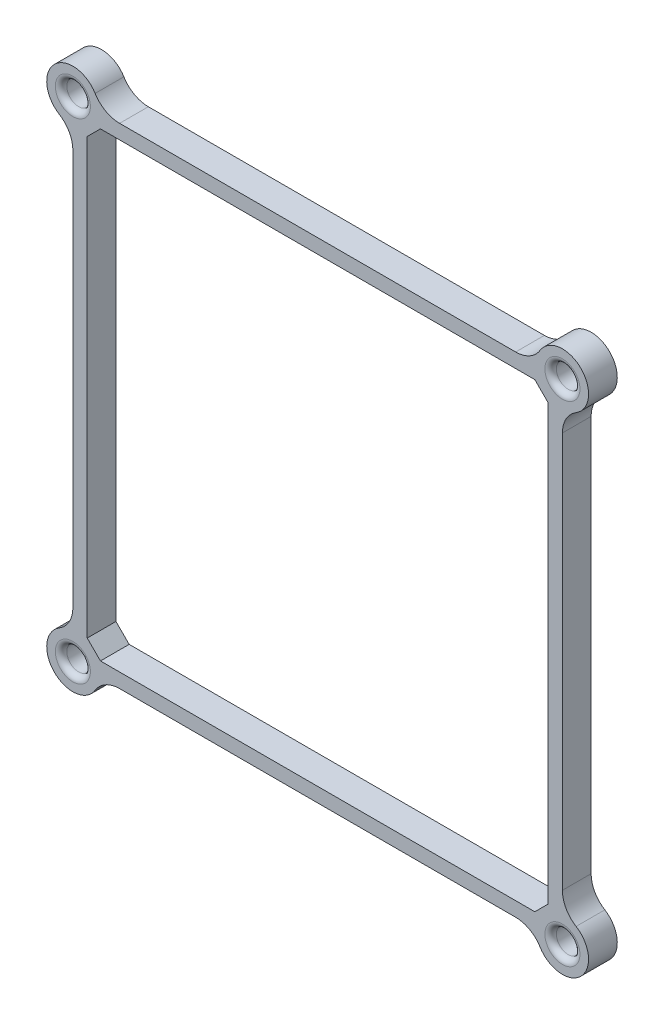
ISO-10303-21;
HEADER;
FILE_DESCRIPTION(('STEP AP214'),'2;1');
FILE_NAME('part.step','',(''),(''),'','','');
FILE_SCHEMA(('AUTOMOTIVE_DESIGN { 1 0 10303 214 1 1 1 1 }'));
ENDSEC;
DATA;
#1=APPLICATION_CONTEXT('core data for automotive mechanical design processes');
#2=APPLICATION_PROTOCOL_DEFINITION('international standard','automotive_design',2000,#1);
#3=PRODUCT_CONTEXT('',#1,'mechanical');
#4=PRODUCT('Part','Part','',(#3));
#5=PRODUCT_RELATED_PRODUCT_CATEGORY('part','',(#4));
#6=PRODUCT_DEFINITION_FORMATION('','',#4);
#7=PRODUCT_DEFINITION_CONTEXT('part definition',#1,'design');
#8=PRODUCT_DEFINITION('design','',#6,#7);
#9=PRODUCT_DEFINITION_SHAPE('','',#8);
#10=(LENGTH_UNIT() NAMED_UNIT(*) SI_UNIT(.MILLI.,.METRE.));
#11=(NAMED_UNIT(*) PLANE_ANGLE_UNIT() SI_UNIT($,.RADIAN.));
#12=(NAMED_UNIT(*) SI_UNIT($,.STERADIAN.) SOLID_ANGLE_UNIT());
#13=UNCERTAINTY_MEASURE_WITH_UNIT(LENGTH_MEASURE(1.E-05),#10,'distance_accuracy_value','');
#14=(GEOMETRIC_REPRESENTATION_CONTEXT(3) GLOBAL_UNCERTAINTY_ASSIGNED_CONTEXT((#13)) GLOBAL_UNIT_ASSIGNED_CONTEXT((#10,
#11,#12)) REPRESENTATION_CONTEXT('',''));
#15=CARTESIAN_POINT('',(0.,0.,0.));
#16=DIRECTION('',(0.,0.,1.));
#17=DIRECTION('',(1.,0.,0.));
#18=AXIS2_PLACEMENT_3D('',#15,#16,#17);
#19=CARTESIAN_POINT('',(82.7,-82.7,5.));
#20=DIRECTION('',(0.,0.,-1.));
#21=DIRECTION('',(-1.,0.,0.));
#22=AXIS2_PLACEMENT_3D('',#19,#20,#21);
#23=CYLINDRICAL_SURFACE('',#22,2.04999999999999);
#24=CARTESIAN_POINT('',(82.7,-82.7,4.));
#25=DIRECTION('',(0.,0.,1.));
#26=DIRECTION('',(1.,0.,0.));
#27=AXIS2_PLACEMENT_3D('',#24,#25,#26);
#28=CIRCLE('',#27,2.04999999999999);
#29=CARTESIAN_POINT('',(84.75,-82.7,4.));
#30=VERTEX_POINT('',#29);
#31=EDGE_CURVE('E348',#30,#30,#28,.T.);
#32=ORIENTED_EDGE('',*,*,#31,.T.);
#33=EDGE_LOOP('',(#32));
#34=FACE_BOUND('',#33,.T.);
#35=CARTESIAN_POINT('',(82.7,-82.7,1.));
#36=DIRECTION('',(0.,0.,-1.));
#37=DIRECTION('',(-1.,0.,0.));
#38=AXIS2_PLACEMENT_3D('',#35,#36,#37);
#39=CIRCLE('',#38,2.04999999999999);
#40=CARTESIAN_POINT('',(80.65,-82.7,1.));
#41=VERTEX_POINT('',#40);
#42=EDGE_CURVE('E502',#41,#41,#39,.T.);
#43=ORIENTED_EDGE('',*,*,#42,.T.);
#44=EDGE_LOOP('',(#43));
#45=FACE_BOUND('',#44,.T.);
#46=ADVANCED_FACE('F41',(#34,#45),#23,.F.);
#47=CARTESIAN_POINT('',(-2.5,-82.7,5.));
#48=DIRECTION('',(0.,0.,-1.));
#49=DIRECTION('',(-1.,0.,0.));
#50=AXIS2_PLACEMENT_3D('',#47,#48,#49);
#51=CYLINDRICAL_SURFACE('',#50,2.05);
#52=CARTESIAN_POINT('',(-2.5,-82.7,4.));
#53=DIRECTION('',(0.,0.,1.));
#54=DIRECTION('',(1.,0.,0.));
#55=AXIS2_PLACEMENT_3D('',#52,#53,#54);
#56=CIRCLE('',#55,2.05);
#57=CARTESIAN_POINT('',(-0.450000000000002,-82.7,4.));
#58=VERTEX_POINT('',#57);
#59=EDGE_CURVE('E333',#58,#58,#56,.T.);
#60=ORIENTED_EDGE('',*,*,#59,.T.);
#61=EDGE_LOOP('',(#60));
#62=FACE_BOUND('',#61,.T.);
#63=CARTESIAN_POINT('',(-2.5,-82.7,1.));
#64=DIRECTION('',(0.,0.,-1.));
#65=DIRECTION('',(-1.,0.,0.));
#66=AXIS2_PLACEMENT_3D('',#63,#64,#65);
#67=CIRCLE('',#66,2.05);
#68=CARTESIAN_POINT('',(-4.55,-82.7,1.));
#69=VERTEX_POINT('',#68);
#70=EDGE_CURVE('E499',#69,#69,#67,.T.);
#71=ORIENTED_EDGE('',*,*,#70,.T.);
#72=EDGE_LOOP('',(#71));
#73=FACE_BOUND('',#72,.T.);
#74=ADVANCED_FACE('F371',(#62,#73),#51,.F.);
#75=CARTESIAN_POINT('',(-2.50000000000029,2.5,5.));
#76=DIRECTION('',(0.,0.,-1.));
#77=DIRECTION('',(-1.,0.,0.));
#78=AXIS2_PLACEMENT_3D('',#75,#76,#77);
#79=CYLINDRICAL_SURFACE('',#78,2.05);
#80=CARTESIAN_POINT('',(-2.50000000000029,2.5,4.));
#81=DIRECTION('',(0.,0.,1.));
#82=DIRECTION('',(1.,0.,0.));
#83=AXIS2_PLACEMENT_3D('',#80,#81,#82);
#84=CIRCLE('',#83,2.05);
#85=CARTESIAN_POINT('',(-0.450000000000293,2.5,4.));
#86=VERTEX_POINT('',#85);
#87=EDGE_CURVE('E11',#86,#86,#84,.T.);
#88=ORIENTED_EDGE('',*,*,#87,.T.);
#89=EDGE_LOOP('',(#88));
#90=FACE_BOUND('',#89,.T.);
#91=CARTESIAN_POINT('',(-2.50000000000029,2.5,1.));
#92=DIRECTION('',(0.,0.,-1.));
#93=DIRECTION('',(-1.,0.,0.));
#94=AXIS2_PLACEMENT_3D('',#91,#92,#93);
#95=CIRCLE('',#94,2.05);
#96=CARTESIAN_POINT('',(-4.55000000000029,2.5,1.));
#97=VERTEX_POINT('',#96);
#98=EDGE_CURVE('E501',#97,#97,#95,.T.);
#99=ORIENTED_EDGE('',*,*,#98,.T.);
#100=EDGE_LOOP('',(#99));
#101=FACE_BOUND('',#100,.T.);
#102=ADVANCED_FACE('F377',(#90,#101),#79,.F.);
#103=CARTESIAN_POINT('',(82.6999999999997,2.5,5.));
#104=DIRECTION('',(0.,0.,-1.));
#105=DIRECTION('',(-1.,0.,0.));
#106=AXIS2_PLACEMENT_3D('',#103,#104,#105);
#107=CYLINDRICAL_SURFACE('',#106,2.04999999999999);
#108=CARTESIAN_POINT('',(82.6999999999997,2.5,4.));
#109=DIRECTION('',(0.,0.,1.));
#110=DIRECTION('',(1.,0.,0.));
#111=AXIS2_PLACEMENT_3D('',#108,#109,#110);
#112=CIRCLE('',#111,2.04999999999999);
#113=CARTESIAN_POINT('',(84.7499999999997,2.5,4.));
#114=VERTEX_POINT('',#113);
#115=EDGE_CURVE('E49',#114,#114,#112,.T.);
#116=ORIENTED_EDGE('',*,*,#115,.T.);
#117=EDGE_LOOP('',(#116));
#118=FACE_BOUND('',#117,.T.);
#119=CARTESIAN_POINT('',(82.6999999999997,2.5,1.));
#120=DIRECTION('',(0.,0.,-1.));
#121=DIRECTION('',(-1.,0.,0.));
#122=AXIS2_PLACEMENT_3D('',#119,#120,#121);
#123=CIRCLE('',#122,2.04999999999999);
#124=CARTESIAN_POINT('',(80.6499999999997,2.5,1.));
#125=VERTEX_POINT('',#124);
#126=EDGE_CURVE('E505',#125,#125,#123,.T.);
#127=ORIENTED_EDGE('',*,*,#126,.T.);
#128=EDGE_LOOP('',(#127));
#129=FACE_BOUND('',#128,.T.);
#130=ADVANCED_FACE('F353',(#118,#129),#107,.F.);
#131=CARTESIAN_POINT('',(-2.50000000000029,2.5,5.));
#132=DIRECTION('',(0.,0.,-1.));
#133=DIRECTION('',(-1.,0.,0.));
#134=AXIS2_PLACEMENT_3D('',#131,#132,#133);
#135=CYLINDRICAL_SURFACE('',#134,4.55);
#136=DIRECTION('',(0.,0.,-1.));
#137=VECTOR('',#136,1.);
#138=CARTESIAN_POINT('',(-4.88219895287973,-1.37654848401256,5.));
#139=LINE('',#138,#137);
#140=CARTESIAN_POINT('',(-4.88219895287973,-1.37654848401256,0.));
#141=VERTEX_POINT('',#140);
#142=CARTESIAN_POINT('',(-4.88219895287973,-1.37654848401256,5.));
#143=VERTEX_POINT('',#142);
#144=EDGE_CURVE('E56',#141,#143,#139,.F.);
#145=ORIENTED_EDGE('',*,*,#144,.T.);
#146=CARTESIAN_POINT('',(-2.50000000000029,2.5,5.));
#147=DIRECTION('',(0.,0.,1.));
#148=DIRECTION('',(1.,0.,0.));
#149=AXIS2_PLACEMENT_3D('',#146,#147,#148);
#150=CIRCLE('',#149,4.55);
#151=CARTESIAN_POINT('',(1.37654848401218,4.88219895287958,5.));
#152=VERTEX_POINT('',#151);
#153=EDGE_CURVE('E524',#152,#143,#150,.T.);
#154=ORIENTED_EDGE('',*,*,#153,.F.);
#155=DIRECTION('',(0.,0.,-1.));
#156=VECTOR('',#155,1.);
#157=CARTESIAN_POINT('',(1.37654848401218,4.88219895287958,5.));
#158=LINE('',#157,#156);
#159=CARTESIAN_POINT('',(1.37654848401218,4.88219895287958,0.));
#160=VERTEX_POINT('',#159);
#161=EDGE_CURVE('E300',#152,#160,#158,.T.);
#162=ORIENTED_EDGE('',*,*,#161,.T.);
#163=CARTESIAN_POINT('',(-2.50000000000029,2.5,0.));
#164=DIRECTION('',(0.,0.,1.));
#165=DIRECTION('',(1.,0.,0.));
#166=AXIS2_PLACEMENT_3D('',#163,#164,#165);
#167=CIRCLE('',#166,4.55);
#168=EDGE_CURVE('E548',#160,#141,#167,.T.);
#169=ORIENTED_EDGE('',*,*,#168,.T.);
#170=EDGE_LOOP('',(#145,#154,#162,#169));
#171=FACE_BOUND('',#170,.T.);
#172=ADVANCED_FACE('F412',(#171),#135,.T.);
#173=CARTESIAN_POINT('',(-2.5,0.,5.));
#174=DIRECTION('',(1.,0.,0.));
#175=DIRECTION('',(0.,0.,-1.));
#176=AXIS2_PLACEMENT_3D('',#173,#174,#175);
#177=PLANE('',#176);
#178=DIRECTION('',(0.,-1.,0.));
#179=VECTOR('',#178,1.);
#180=CARTESIAN_POINT('',(-2.5,0.,0.));
#181=LINE('',#180,#179);
#182=CARTESIAN_POINT('',(-2.5,-5.63649187303735,0.));
#183=VERTEX_POINT('',#182);
#184=CARTESIAN_POINT('',(-2.5,-74.5635081269628,0.));
#185=VERTEX_POINT('',#184);
#186=EDGE_CURVE('E550',#183,#185,#181,.T.);
#187=ORIENTED_EDGE('',*,*,#186,.T.);
#188=DIRECTION('',(0.,0.,1.));
#189=VECTOR('',#188,1.);
#190=CARTESIAN_POINT('',(-2.5,-74.5635081269628,5.));
#191=LINE('',#190,#189);
#192=CARTESIAN_POINT('',(-2.5,-74.5635081269628,5.));
#193=VERTEX_POINT('',#192);
#194=EDGE_CURVE('E274',#185,#193,#191,.T.);
#195=ORIENTED_EDGE('',*,*,#194,.T.);
#196=DIRECTION('',(0.,-1.,0.));
#197=VECTOR('',#196,1.);
#198=CARTESIAN_POINT('',(-2.5,0.,5.));
#199=LINE('',#198,#197);
#200=CARTESIAN_POINT('',(-2.5,-5.63649187303735,5.));
#201=VERTEX_POINT('',#200);
#202=EDGE_CURVE('E526',#201,#193,#199,.T.);
#203=ORIENTED_EDGE('',*,*,#202,.F.);
#204=DIRECTION('',(0.,0.,1.));
#205=VECTOR('',#204,1.);
#206=CARTESIAN_POINT('',(-2.5,-5.63649187303735,0.));
#207=LINE('',#206,#205);
#208=EDGE_CURVE('E271',#201,#183,#207,.F.);
#209=ORIENTED_EDGE('',*,*,#208,.T.);
#210=EDGE_LOOP('',(#187,#195,#203,#209));
#211=FACE_BOUND('',#210,.T.);
#212=ADVANCED_FACE('F408',(#211),#177,.F.);
#213=CARTESIAN_POINT('',(-2.5,-82.7,5.));
#214=DIRECTION('',(0.,0.,-1.));
#215=DIRECTION('',(-1.,0.,0.));
#216=AXIS2_PLACEMENT_3D('',#213,#214,#215);
#217=CYLINDRICAL_SURFACE('',#216,4.55);
#218=DIRECTION('',(0.,0.,-1.));
#219=VECTOR('',#218,1.);
#220=CARTESIAN_POINT('',(1.37654848401247,-85.0821989528796,5.));
#221=LINE('',#220,#219);
#222=CARTESIAN_POINT('',(1.37654848401248,-85.0821989528796,0.));
#223=VERTEX_POINT('',#222);
#224=CARTESIAN_POINT('',(1.37654848401248,-85.0821989528796,5.));
#225=VERTEX_POINT('',#224);
#226=EDGE_CURVE('E267',#223,#225,#221,.F.);
#227=ORIENTED_EDGE('',*,*,#226,.T.);
#228=CARTESIAN_POINT('',(-2.5,-82.7,5.));
#229=DIRECTION('',(0.,0.,1.));
#230=DIRECTION('',(1.,0.,0.));
#231=AXIS2_PLACEMENT_3D('',#228,#229,#230);
#232=CIRCLE('',#231,4.55);
#233=CARTESIAN_POINT('',(-4.88219895287958,-78.8234515159875,5.));
#234=VERTEX_POINT('',#233);
#235=EDGE_CURVE('E529',#234,#225,#232,.T.);
#236=ORIENTED_EDGE('',*,*,#235,.F.);
#237=DIRECTION('',(0.,0.,-1.));
#238=VECTOR('',#237,1.);
#239=CARTESIAN_POINT('',(-4.88219895287958,-78.8234515159875,5.));
#240=LINE('',#239,#238);
#241=CARTESIAN_POINT('',(-4.88219895287958,-78.8234515159875,0.));
#242=VERTEX_POINT('',#241);
#243=EDGE_CURVE('E269',#234,#242,#240,.T.);
#244=ORIENTED_EDGE('',*,*,#243,.T.);
#245=CARTESIAN_POINT('',(-2.5,-82.7,0.));
#246=DIRECTION('',(0.,0.,1.));
#247=DIRECTION('',(1.,0.,0.));
#248=AXIS2_PLACEMENT_3D('',#245,#246,#247);
#249=CIRCLE('',#248,4.55);
#250=EDGE_CURVE('E553',#242,#223,#249,.T.);
#251=ORIENTED_EDGE('',*,*,#250,.T.);
#252=EDGE_LOOP('',(#227,#236,#244,#251));
#253=FACE_BOUND('',#252,.T.);
#254=ADVANCED_FACE('F404',(#253),#217,.T.);
#255=CARTESIAN_POINT('',(0.,-82.7,5.));
#256=DIRECTION('',(0.,1.,0.));
#257=DIRECTION('',(0.,0.,1.));
#258=AXIS2_PLACEMENT_3D('',#255,#256,#257);
#259=PLANE('',#258);
#260=DIRECTION('',(1.,0.,0.));
#261=VECTOR('',#260,1.);
#262=CARTESIAN_POINT('',(0.,-82.7,5.));
#263=LINE('',#262,#261);
#264=CARTESIAN_POINT('',(5.63649187303717,-82.7,5.));
#265=VERTEX_POINT('',#264);
#266=CARTESIAN_POINT('',(74.5635081269628,-82.7,5.));
#267=VERTEX_POINT('',#266);
#268=EDGE_CURVE('E532',#265,#267,#263,.T.);
#269=ORIENTED_EDGE('',*,*,#268,.F.);
#270=DIRECTION('',(0.,0.,1.));
#271=VECTOR('',#270,1.);
#272=CARTESIAN_POINT('',(5.63649187303717,-82.7,0.));
#273=LINE('',#272,#271);
#274=CARTESIAN_POINT('',(5.63649187303717,-82.7,0.));
#275=VERTEX_POINT('',#274);
#276=EDGE_CURVE('E278',#265,#275,#273,.F.);
#277=ORIENTED_EDGE('',*,*,#276,.T.);
#278=DIRECTION('',(1.,0.,0.));
#279=VECTOR('',#278,1.);
#280=CARTESIAN_POINT('',(0.,-82.7,0.));
#281=LINE('',#280,#279);
#282=CARTESIAN_POINT('',(74.5635081269628,-82.7,0.));
#283=VERTEX_POINT('',#282);
#284=EDGE_CURVE('E556',#275,#283,#281,.T.);
#285=ORIENTED_EDGE('',*,*,#284,.T.);
#286=DIRECTION('',(0.,0.,1.));
#287=VECTOR('',#286,1.);
#288=CARTESIAN_POINT('',(74.5635081269628,-82.7,5.));
#289=LINE('',#288,#287);
#290=EDGE_CURVE('E276',#283,#267,#289,.T.);
#291=ORIENTED_EDGE('',*,*,#290,.T.);
#292=EDGE_LOOP('',(#269,#277,#285,#291));
#293=FACE_BOUND('',#292,.T.);
#294=ADVANCED_FACE('F400',(#293),#259,.F.);
#295=CARTESIAN_POINT('',(82.7,-82.7,5.));
#296=DIRECTION('',(0.,0.,-1.));
#297=DIRECTION('',(-1.,0.,0.));
#298=AXIS2_PLACEMENT_3D('',#295,#296,#297);
#299=CYLINDRICAL_SURFACE('',#298,4.55);
#300=DIRECTION('',(0.,0.,-1.));
#301=VECTOR('',#300,1.);
#302=CARTESIAN_POINT('',(85.0821989528796,-78.8234515159875,5.));
#303=LINE('',#302,#301);
#304=CARTESIAN_POINT('',(85.0821989528796,-78.8234515159875,0.));
#305=VERTEX_POINT('',#304);
#306=CARTESIAN_POINT('',(85.0821989528796,-78.8234515159875,5.));
#307=VERTEX_POINT('',#306);
#308=EDGE_CURVE('E281',#305,#307,#303,.F.);
#309=ORIENTED_EDGE('',*,*,#308,.T.);
#310=CARTESIAN_POINT('',(82.7,-82.7,5.));
#311=DIRECTION('',(0.,0.,1.));
#312=DIRECTION('',(1.,0.,0.));
#313=AXIS2_PLACEMENT_3D('',#310,#311,#312);
#314=CIRCLE('',#313,4.55);
#315=CARTESIAN_POINT('',(78.8234515159875,-85.0821989528796,5.));
#316=VERTEX_POINT('',#315);
#317=EDGE_CURVE('E535',#316,#307,#314,.T.);
#318=ORIENTED_EDGE('',*,*,#317,.F.);
#319=DIRECTION('',(0.,0.,-1.));
#320=VECTOR('',#319,1.);
#321=CARTESIAN_POINT('',(78.8234515159875,-85.0821989528796,5.));
#322=LINE('',#321,#320);
#323=CARTESIAN_POINT('',(78.8234515159875,-85.0821989528796,0.));
#324=VERTEX_POINT('',#323);
#325=EDGE_CURVE('E283',#316,#324,#322,.T.);
#326=ORIENTED_EDGE('',*,*,#325,.T.);
#327=CARTESIAN_POINT('',(82.7,-82.7,0.));
#328=DIRECTION('',(0.,0.,1.));
#329=DIRECTION('',(1.,0.,0.));
#330=AXIS2_PLACEMENT_3D('',#327,#328,#329);
#331=CIRCLE('',#330,4.55);
#332=EDGE_CURVE('E559',#324,#305,#331,.T.);
#333=ORIENTED_EDGE('',*,*,#332,.T.);
#334=EDGE_LOOP('',(#309,#318,#326,#333));
#335=FACE_BOUND('',#334,.T.);
#336=ADVANCED_FACE('F396',(#335),#299,.T.);
#337=CARTESIAN_POINT('',(82.7,0.,5.));
#338=DIRECTION('',(1.,0.,0.));
#339=DIRECTION('',(0.,0.,-1.));
#340=AXIS2_PLACEMENT_3D('',#337,#338,#339);
#341=PLANE('',#340);
#342=DIRECTION('',(0.,-1.,0.));
#343=VECTOR('',#342,1.);
#344=CARTESIAN_POINT('',(82.7,0.,5.));
#345=LINE('',#344,#343);
#346=CARTESIAN_POINT('',(82.7,-5.63649187303699,5.));
#347=VERTEX_POINT('',#346);
#348=CARTESIAN_POINT('',(82.7,-74.5635081269628,5.));
#349=VERTEX_POINT('',#348);
#350=EDGE_CURVE('E538',#347,#349,#345,.T.);
#351=ORIENTED_EDGE('',*,*,#350,.T.);
#352=DIRECTION('',(0.,0.,-1.));
#353=VECTOR('',#352,1.);
#354=CARTESIAN_POINT('',(82.7,-74.5635081269628,5.));
#355=LINE('',#354,#353);
#356=CARTESIAN_POINT('',(82.7,-74.5635081269628,0.));
#357=VERTEX_POINT('',#356);
#358=EDGE_CURVE('E287',#349,#357,#355,.T.);
#359=ORIENTED_EDGE('',*,*,#358,.T.);
#360=DIRECTION('',(0.,-1.,0.));
#361=VECTOR('',#360,1.);
#362=CARTESIAN_POINT('',(82.7,0.,0.));
#363=LINE('',#362,#361);
#364=CARTESIAN_POINT('',(82.7,-5.63649187303699,0.));
#365=VERTEX_POINT('',#364);
#366=EDGE_CURVE('E562',#365,#357,#363,.T.);
#367=ORIENTED_EDGE('',*,*,#366,.F.);
#368=DIRECTION('',(0.,0.,-1.));
#369=VECTOR('',#368,1.);
#370=CARTESIAN_POINT('',(82.7,-5.63649187303699,5.));
#371=LINE('',#370,#369);
#372=EDGE_CURVE('E285',#365,#347,#371,.F.);
#373=ORIENTED_EDGE('',*,*,#372,.T.);
#374=EDGE_LOOP('',(#351,#359,#367,#373));
#375=FACE_BOUND('',#374,.T.);
#376=ADVANCED_FACE('F392',(#375),#341,.T.);
#377=CARTESIAN_POINT('',(82.6999999999997,2.5,5.));
#378=DIRECTION('',(0.,0.,-1.));
#379=DIRECTION('',(-1.,0.,0.));
#380=AXIS2_PLACEMENT_3D('',#377,#378,#379);
#381=CYLINDRICAL_SURFACE('',#380,4.55);
#382=DIRECTION('',(0.,0.,-1.));
#383=VECTOR('',#382,1.);
#384=CARTESIAN_POINT('',(78.8234515159872,4.88219895287958,5.));
#385=LINE('',#384,#383);
#386=CARTESIAN_POINT('',(78.8234515159872,4.88219895287958,0.));
#387=VERTEX_POINT('',#386);
#388=CARTESIAN_POINT('',(78.8234515159872,4.88219895287958,5.));
#389=VERTEX_POINT('',#388);
#390=EDGE_CURVE('E290',#387,#389,#385,.F.);
#391=ORIENTED_EDGE('',*,*,#390,.T.);
#392=CARTESIAN_POINT('',(82.6999999999997,2.5,5.));
#393=DIRECTION('',(0.,0.,1.));
#394=DIRECTION('',(1.,0.,0.));
#395=AXIS2_PLACEMENT_3D('',#392,#393,#394);
#396=CIRCLE('',#395,4.55);
#397=CARTESIAN_POINT('',(85.0821989528794,-1.37654848401239,5.));
#398=VERTEX_POINT('',#397);
#399=EDGE_CURVE('E236',#398,#389,#396,.T.);
#400=ORIENTED_EDGE('',*,*,#399,.F.);
#401=DIRECTION('',(0.,0.,-1.));
#402=VECTOR('',#401,1.);
#403=CARTESIAN_POINT('',(85.0821989528794,-1.37654848401239,5.));
#404=LINE('',#403,#402);
#405=CARTESIAN_POINT('',(85.0821989528794,-1.37654848401239,0.));
#406=VERTEX_POINT('',#405);
#407=EDGE_CURVE('E292',#398,#406,#404,.T.);
#408=ORIENTED_EDGE('',*,*,#407,.T.);
#409=CARTESIAN_POINT('',(82.6999999999997,2.5,0.));
#410=DIRECTION('',(0.,0.,1.));
#411=DIRECTION('',(1.,0.,0.));
#412=AXIS2_PLACEMENT_3D('',#409,#410,#411);
#413=CIRCLE('',#412,4.55);
#414=EDGE_CURVE('E564',#406,#387,#413,.T.);
#415=ORIENTED_EDGE('',*,*,#414,.T.);
#416=EDGE_LOOP('',(#391,#400,#408,#415));
#417=FACE_BOUND('',#416,.T.);
#418=ADVANCED_FACE('F388',(#417),#381,.T.);
#419=CARTESIAN_POINT('',(0.,0.,5.));
#420=DIRECTION('',(0.,1.,0.));
#421=DIRECTION('',(0.,0.,1.));
#422=AXIS2_PLACEMENT_3D('',#419,#420,#421);
#423=PLANE('',#422);
#424=DIRECTION('',(1.,0.,0.));
#425=VECTOR('',#424,1.);
#426=CARTESIAN_POINT('',(0.,0.,0.));
#427=LINE('',#426,#425);
#428=CARTESIAN_POINT('',(2.30000000000001,0.,0.));
#429=VERTEX_POINT('',#428);
#430=CARTESIAN_POINT('',(77.9,0.,0.));
#431=VERTEX_POINT('',#430);
#432=EDGE_CURVE('E512',#429,#431,#427,.T.);
#433=ORIENTED_EDGE('',*,*,#432,.T.);
#434=DIRECTION('',(0.,0.,1.));
#435=VECTOR('',#434,1.);
#436=CARTESIAN_POINT('',(77.9,0.,5.));
#437=LINE('',#436,#435);
#438=CARTESIAN_POINT('',(77.9,0.,5.));
#439=VERTEX_POINT('',#438);
#440=EDGE_CURVE('E253',#431,#439,#437,.T.);
#441=ORIENTED_EDGE('',*,*,#440,.T.);
#442=DIRECTION('',(1.,0.,0.));
#443=VECTOR('',#442,1.);
#444=CARTESIAN_POINT('',(0.,0.,5.));
#445=LINE('',#444,#443);
#446=CARTESIAN_POINT('',(2.30000000000001,0.,5.));
#447=VERTEX_POINT('',#446);
#448=EDGE_CURVE('E513',#447,#439,#445,.T.);
#449=ORIENTED_EDGE('',*,*,#448,.F.);
#450=DIRECTION('',(0.,0.,-1.));
#451=VECTOR('',#450,1.);
#452=CARTESIAN_POINT('',(2.30000000000001,0.,5.));
#453=LINE('',#452,#451);
#454=EDGE_CURVE('E250',#447,#429,#453,.T.);
#455=ORIENTED_EDGE('',*,*,#454,.T.);
#456=EDGE_LOOP('',(#433,#441,#449,#455));
#457=FACE_BOUND('',#456,.T.);
#458=ADVANCED_FACE('F391',(#457),#423,.F.);
#459=CARTESIAN_POINT('',(80.2,0.,5.));
#460=DIRECTION('',(1.,0.,0.));
#461=DIRECTION('',(0.,1.,0.));
#462=AXIS2_PLACEMENT_3D('',#459,#460,#461);
#463=PLANE('',#462);
#464=DIRECTION('',(0.,-1.,0.));
#465=VECTOR('',#464,1.);
#466=CARTESIAN_POINT('',(80.2,0.,0.));
#467=LINE('',#466,#465);
#468=CARTESIAN_POINT('',(80.2,-2.3,0.));
#469=VERTEX_POINT('',#468);
#470=CARTESIAN_POINT('',(80.2,-77.9,0.));
#471=VERTEX_POINT('',#470);
#472=EDGE_CURVE('E227',#469,#471,#467,.T.);
#473=ORIENTED_EDGE('',*,*,#472,.T.);
#474=DIRECTION('',(0.,0.,1.));
#475=VECTOR('',#474,1.);
#476=CARTESIAN_POINT('',(80.2,-77.9,5.));
#477=LINE('',#476,#475);
#478=CARTESIAN_POINT('',(80.2,-77.9,5.));
#479=VERTEX_POINT('',#478);
#480=EDGE_CURVE('E244',#471,#479,#477,.T.);
#481=ORIENTED_EDGE('',*,*,#480,.T.);
#482=DIRECTION('',(0.,-1.,0.));
#483=VECTOR('',#482,1.);
#484=CARTESIAN_POINT('',(80.2,0.,5.));
#485=LINE('',#484,#483);
#486=CARTESIAN_POINT('',(80.2,-2.3,5.));
#487=VERTEX_POINT('',#486);
#488=EDGE_CURVE('E516',#487,#479,#485,.T.);
#489=ORIENTED_EDGE('',*,*,#488,.F.);
#490=DIRECTION('',(0.,0.,-1.));
#491=VECTOR('',#490,1.);
#492=CARTESIAN_POINT('',(80.2,-2.3,0.));
#493=LINE('',#492,#491);
#494=EDGE_CURVE('E233',#487,#469,#493,.T.);
#495=ORIENTED_EDGE('',*,*,#494,.T.);
#496=EDGE_LOOP('',(#473,#481,#489,#495));
#497=FACE_BOUND('',#496,.T.);
#498=ADVANCED_FACE('F422',(#497),#463,.F.);
#499=CARTESIAN_POINT('',(0.,-80.2,5.));
#500=DIRECTION('',(0.,1.,0.));
#501=DIRECTION('',(0.,0.,1.));
#502=AXIS2_PLACEMENT_3D('',#499,#500,#501);
#503=PLANE('',#502);
#504=DIRECTION('',(1.,0.,0.));
#505=VECTOR('',#504,1.);
#506=CARTESIAN_POINT('',(0.,-80.2,5.));
#507=LINE('',#506,#505);
#508=CARTESIAN_POINT('',(2.29999999999999,-80.2,5.));
#509=VERTEX_POINT('',#508);
#510=CARTESIAN_POINT('',(77.9,-80.2,5.));
#511=VERTEX_POINT('',#510);
#512=EDGE_CURVE('E519',#509,#511,#507,.T.);
#513=ORIENTED_EDGE('',*,*,#512,.T.);
#514=DIRECTION('',(0.,0.,-1.));
#515=VECTOR('',#514,1.);
#516=CARTESIAN_POINT('',(77.9,-80.2,5.));
#517=LINE('',#516,#515);
#518=CARTESIAN_POINT('',(77.9,-80.2,0.));
#519=VERTEX_POINT('',#518);
#520=EDGE_CURVE('E226',#511,#519,#517,.T.);
#521=ORIENTED_EDGE('',*,*,#520,.T.);
#522=DIRECTION('',(1.,0.,0.));
#523=VECTOR('',#522,1.);
#524=CARTESIAN_POINT('',(0.,-80.2,0.));
#525=LINE('',#524,#523);
#526=CARTESIAN_POINT('',(2.29999999999999,-80.2,0.));
#527=VERTEX_POINT('',#526);
#528=EDGE_CURVE('E209',#527,#519,#525,.T.);
#529=ORIENTED_EDGE('',*,*,#528,.F.);
#530=DIRECTION('',(0.,0.,1.));
#531=VECTOR('',#530,1.);
#532=CARTESIAN_POINT('',(2.29999999999999,-80.2,5.));
#533=LINE('',#532,#531);
#534=EDGE_CURVE('E223',#527,#509,#533,.T.);
#535=ORIENTED_EDGE('',*,*,#534,.T.);
#536=EDGE_LOOP('',(#513,#521,#529,#535));
#537=FACE_BOUND('',#536,.T.);
#538=ADVANCED_FACE('F222',(#537),#503,.T.);
#539=CARTESIAN_POINT('',(0.,2.5,5.));
#540=DIRECTION('',(0.,1.,0.));
#541=DIRECTION('',(0.,0.,1.));
#542=AXIS2_PLACEMENT_3D('',#539,#540,#541);
#543=PLANE('',#542);
#544=DIRECTION('',(1.,0.,0.));
#545=VECTOR('',#544,1.);
#546=CARTESIAN_POINT('',(0.,2.5,5.));
#547=LINE('',#546,#545);
#548=CARTESIAN_POINT('',(5.63649187303688,2.5,5.));
#549=VERTEX_POINT('',#548);
#550=CARTESIAN_POINT('',(74.5635081269625,2.5,5.));
#551=VERTEX_POINT('',#550);
#552=EDGE_CURVE('E231',#549,#551,#547,.T.);
#553=ORIENTED_EDGE('',*,*,#552,.T.);
#554=DIRECTION('',(0.,0.,-1.));
#555=VECTOR('',#554,1.);
#556=CARTESIAN_POINT('',(74.5635081269625,2.5,5.));
#557=LINE('',#556,#555);
#558=CARTESIAN_POINT('',(74.5635081269625,2.5,0.));
#559=VERTEX_POINT('',#558);
#560=EDGE_CURVE('E296',#551,#559,#557,.T.);
#561=ORIENTED_EDGE('',*,*,#560,.T.);
#562=DIRECTION('',(1.,0.,0.));
#563=VECTOR('',#562,1.);
#564=CARTESIAN_POINT('',(0.,2.5,0.));
#565=LINE('',#564,#563);
#566=CARTESIAN_POINT('',(5.63649187303688,2.5,0.));
#567=VERTEX_POINT('',#566);
#568=EDGE_CURVE('E239',#567,#559,#565,.T.);
#569=ORIENTED_EDGE('',*,*,#568,.F.);
#570=DIRECTION('',(0.,0.,-1.));
#571=VECTOR('',#570,1.);
#572=CARTESIAN_POINT('',(5.63649187303688,2.5,5.));
#573=LINE('',#572,#571);
#574=EDGE_CURVE('E294',#567,#549,#573,.F.);
#575=ORIENTED_EDGE('',*,*,#574,.T.);
#576=EDGE_LOOP('',(#553,#561,#569,#575));
#577=FACE_BOUND('',#576,.T.);
#578=ADVANCED_FACE('F383',(#577),#543,.T.);
#579=CARTESIAN_POINT('',(0.,0.,5.));
#580=DIRECTION('',(1.,0.,0.));
#581=DIRECTION('',(0.,1.,0.));
#582=AXIS2_PLACEMENT_3D('',#579,#580,#581);
#583=PLANE('',#582);
#584=DIRECTION('',(0.,-1.,0.));
#585=VECTOR('',#584,1.);
#586=CARTESIAN_POINT('',(0.,0.,5.));
#587=LINE('',#586,#585);
#588=CARTESIAN_POINT('',(0.,-2.29999999999998,5.));
#589=VERTEX_POINT('',#588);
#590=CARTESIAN_POINT('',(0.,-77.9,5.));
#591=VERTEX_POINT('',#590);
#592=EDGE_CURVE('E521',#589,#591,#587,.T.);
#593=ORIENTED_EDGE('',*,*,#592,.T.);
#594=DIRECTION('',(0.,0.,-1.));
#595=VECTOR('',#594,1.);
#596=CARTESIAN_POINT('',(0.,-77.9,0.));
#597=LINE('',#596,#595);
#598=CARTESIAN_POINT('',(0.,-77.9,0.));
#599=VERTEX_POINT('',#598);
#600=EDGE_CURVE('E248',#591,#599,#597,.T.);
#601=ORIENTED_EDGE('',*,*,#600,.T.);
#602=DIRECTION('',(0.,-1.,0.));
#603=VECTOR('',#602,1.);
#604=CARTESIAN_POINT('',(0.,0.,0.));
#605=LINE('',#604,#603);
#606=CARTESIAN_POINT('',(0.,-2.29999999999998,0.));
#607=VERTEX_POINT('',#606);
#608=EDGE_CURVE('E211',#607,#599,#605,.T.);
#609=ORIENTED_EDGE('',*,*,#608,.F.);
#610=DIRECTION('',(0.,0.,1.));
#611=VECTOR('',#610,1.);
#612=CARTESIAN_POINT('',(0.,-2.29999999999998,5.));
#613=LINE('',#612,#611);
#614=EDGE_CURVE('E246',#607,#589,#613,.T.);
#615=ORIENTED_EDGE('',*,*,#614,.T.);
#616=EDGE_LOOP('',(#593,#601,#609,#615));
#617=FACE_BOUND('',#616,.T.);
#618=ADVANCED_FACE('F386',(#617),#583,.T.);
#619=CARTESIAN_POINT('',(0.,0.,5.));
#620=DIRECTION('',(0.,0.,1.));
#621=DIRECTION('',(1.,0.,0.));
#622=AXIS2_PLACEMENT_3D('',#619,#620,#621);
#623=PLANE('',#622);
#624=CARTESIAN_POINT('',(-2.5,-82.7,5.));
#625=DIRECTION('',(0.,0.,1.));
#626=DIRECTION('',(1.,0.,0.));
#627=AXIS2_PLACEMENT_3D('',#624,#625,#626);
#628=CIRCLE('',#627,3.05);
#629=CARTESIAN_POINT('',(0.549999999999998,-82.7,5.));
#630=VERTEX_POINT('',#629);
#631=EDGE_CURVE('E345',#630,#630,#628,.F.);
#632=ORIENTED_EDGE('',*,*,#631,.T.);
#633=EDGE_LOOP('',(#632));
#634=FACE_BOUND('',#633,.T.);
#635=CARTESIAN_POINT('',(82.7,-82.7,5.));
#636=DIRECTION('',(0.,0.,1.));
#637=DIRECTION('',(1.,0.,0.));
#638=AXIS2_PLACEMENT_3D('',#635,#636,#637);
#639=CIRCLE('',#638,3.04999999999999);
#640=CARTESIAN_POINT('',(85.75,-82.7,5.));
#641=VERTEX_POINT('',#640);
#642=EDGE_CURVE('E342',#641,#641,#639,.F.);
#643=ORIENTED_EDGE('',*,*,#642,.T.);
#644=EDGE_LOOP('',(#643));
#645=FACE_BOUND('',#644,.T.);
#646=CARTESIAN_POINT('',(82.6999999999997,2.5,5.));
#647=DIRECTION('',(0.,0.,1.));
#648=DIRECTION('',(1.,0.,0.));
#649=AXIS2_PLACEMENT_3D('',#646,#647,#648);
#650=CIRCLE('',#649,3.04999999999999);
#651=CARTESIAN_POINT('',(85.7499999999997,2.5,5.));
#652=VERTEX_POINT('',#651);
#653=EDGE_CURVE('E339',#652,#652,#650,.F.);
#654=ORIENTED_EDGE('',*,*,#653,.T.);
#655=EDGE_LOOP('',(#654));
#656=FACE_BOUND('',#655,.T.);
#657=CARTESIAN_POINT('',(-2.50000000000029,2.5,5.));
#658=DIRECTION('',(0.,0.,1.));
#659=DIRECTION('',(1.,0.,0.));
#660=AXIS2_PLACEMENT_3D('',#657,#658,#659);
#661=CIRCLE('',#660,3.05);
#662=CARTESIAN_POINT('',(0.549999999999707,2.5,5.));
#663=VERTEX_POINT('',#662);
#664=EDGE_CURVE('E336',#663,#663,#661,.F.);
#665=ORIENTED_EDGE('',*,*,#664,.T.);
#666=EDGE_LOOP('',(#665));
#667=FACE_BOUND('',#666,.T.);
#668=ORIENTED_EDGE('',*,*,#592,.F.);
#669=DIRECTION('',(0.707106781186552,0.707106781186543,0.));
#670=VECTOR('',#669,1.);
#671=CARTESIAN_POINT('',(2.30000000000001,0.,5.));
#672=LINE('',#671,#670);
#673=EDGE_CURVE('E265',#589,#447,#672,.T.);
#674=ORIENTED_EDGE('',*,*,#673,.T.);
#675=ORIENTED_EDGE('',*,*,#448,.T.);
#676=DIRECTION('',(-0.707106781186545,0.70710678118655,0.));
#677=VECTOR('',#676,1.);
#678=CARTESIAN_POINT('',(80.2,-2.3,5.));
#679=LINE('',#678,#677);
#680=EDGE_CURVE('E261',#439,#487,#679,.F.);
#681=ORIENTED_EDGE('',*,*,#680,.T.);
#682=ORIENTED_EDGE('',*,*,#488,.T.);
#683=DIRECTION('',(-0.707106781186552,-0.707106781186543,0.));
#684=VECTOR('',#683,1.);
#685=CARTESIAN_POINT('',(77.9,-80.2,5.));
#686=LINE('',#685,#684);
#687=EDGE_CURVE('E217',#479,#511,#686,.T.);
#688=ORIENTED_EDGE('',*,*,#687,.T.);
#689=ORIENTED_EDGE('',*,*,#512,.F.);
#690=DIRECTION('',(0.707106781186543,-0.707106781186552,0.));
#691=VECTOR('',#690,1.);
#692=CARTESIAN_POINT('',(0.,-77.9,5.));
#693=LINE('',#692,#691);
#694=EDGE_CURVE('E216',#509,#591,#693,.F.);
#695=ORIENTED_EDGE('',*,*,#694,.T.);
#696=EDGE_LOOP('',(#668,#674,#675,#681,#682,#688,#689,#695));
#697=FACE_BOUND('',#696,.T.);
#698=ORIENTED_EDGE('',*,*,#552,.F.);
#699=CARTESIAN_POINT('',(5.63649187303688,7.5,5.));
#700=DIRECTION('',(0.,0.,1.));
#701=DIRECTION('',(1.,0.,0.));
#702=AXIS2_PLACEMENT_3D('',#699,#700,#701);
#703=CIRCLE('',#702,5.);
#704=EDGE_CURVE('E63',#549,#152,#703,.F.);
#705=ORIENTED_EDGE('',*,*,#704,.T.);
#706=ORIENTED_EDGE('',*,*,#153,.T.);
#707=CARTESIAN_POINT('',(-7.5,-5.63649187303735,5.));
#708=DIRECTION('',(0.,0.,1.));
#709=DIRECTION('',(1.,0.,0.));
#710=AXIS2_PLACEMENT_3D('',#707,#708,#709);
#711=CIRCLE('',#710,5.);
#712=EDGE_CURVE('E331',#143,#201,#711,.F.);
#713=ORIENTED_EDGE('',*,*,#712,.T.);
#714=ORIENTED_EDGE('',*,*,#202,.T.);
#715=CARTESIAN_POINT('',(-7.5,-74.5635081269628,5.));
#716=DIRECTION('',(0.,0.,1.));
#717=DIRECTION('',(1.,0.,0.));
#718=AXIS2_PLACEMENT_3D('',#715,#716,#717);
#719=CIRCLE('',#718,5.);
#720=EDGE_CURVE('E304',#193,#234,#719,.F.);
#721=ORIENTED_EDGE('',*,*,#720,.T.);
#722=ORIENTED_EDGE('',*,*,#235,.T.);
#723=CARTESIAN_POINT('',(5.63649187303717,-87.7,5.));
#724=DIRECTION('',(0.,0.,1.));
#725=DIRECTION('',(1.,0.,0.));
#726=AXIS2_PLACEMENT_3D('',#723,#724,#725);
#727=CIRCLE('',#726,5.);
#728=EDGE_CURVE('E308',#225,#265,#727,.F.);
#729=ORIENTED_EDGE('',*,*,#728,.T.);
#730=ORIENTED_EDGE('',*,*,#268,.T.);
#731=CARTESIAN_POINT('',(74.5635081269628,-87.7,5.));
#732=DIRECTION('',(0.,0.,1.));
#733=DIRECTION('',(1.,0.,0.));
#734=AXIS2_PLACEMENT_3D('',#731,#732,#733);
#735=CIRCLE('',#734,5.);
#736=EDGE_CURVE('E312',#267,#316,#735,.F.);
#737=ORIENTED_EDGE('',*,*,#736,.T.);
#738=ORIENTED_EDGE('',*,*,#317,.T.);
#739=CARTESIAN_POINT('',(87.7,-74.5635081269628,5.));
#740=DIRECTION('',(0.,0.,1.));
#741=DIRECTION('',(1.,0.,0.));
#742=AXIS2_PLACEMENT_3D('',#739,#740,#741);
#743=CIRCLE('',#742,5.);
#744=EDGE_CURVE('E316',#307,#349,#743,.F.);
#745=ORIENTED_EDGE('',*,*,#744,.T.);
#746=ORIENTED_EDGE('',*,*,#350,.F.);
#747=CARTESIAN_POINT('',(87.7,-5.63649187303699,5.));
#748=DIRECTION('',(0.,0.,1.));
#749=DIRECTION('',(1.,0.,0.));
#750=AXIS2_PLACEMENT_3D('',#747,#748,#749);
#751=CIRCLE('',#750,5.);
#752=EDGE_CURVE('E320',#347,#398,#751,.F.);
#753=ORIENTED_EDGE('',*,*,#752,.T.);
#754=ORIENTED_EDGE('',*,*,#399,.T.);
#755=CARTESIAN_POINT('',(74.5635081269625,7.5,5.));
#756=DIRECTION('',(0.,0.,1.));
#757=DIRECTION('',(1.,0.,0.));
#758=AXIS2_PLACEMENT_3D('',#755,#756,#757);
#759=CIRCLE('',#758,5.);
#760=EDGE_CURVE('E324',#389,#551,#759,.F.);
#761=ORIENTED_EDGE('',*,*,#760,.T.);
#762=EDGE_LOOP('',(#698,#705,#706,#713,#714,#721,#722,#729,#730,#737,#738,#745,#746,#753,#754,#761));
#763=FACE_BOUND('',#762,.T.);
#764=ADVANCED_FACE('F418',(#634,#645,#656,#667,#697,#763),#623,.T.);
#765=CARTESIAN_POINT('',(0.,0.,0.));
#766=DIRECTION('',(0.,0.,1.));
#767=DIRECTION('',(1.,0.,0.));
#768=AXIS2_PLACEMENT_3D('',#765,#766,#767);
#769=PLANE('',#768);
#770=ORIENTED_EDGE('',*,*,#432,.F.);
#771=DIRECTION('',(-0.707106781186552,-0.707106781186543,0.));
#772=VECTOR('',#771,1.);
#773=CARTESIAN_POINT('',(1.14999999999999,-1.15000000000001,0.));
#774=LINE('',#773,#772);
#775=EDGE_CURVE('E263',#429,#607,#774,.T.);
#776=ORIENTED_EDGE('',*,*,#775,.T.);
#777=ORIENTED_EDGE('',*,*,#608,.T.);
#778=DIRECTION('',(-0.707106781186543,0.707106781186552,0.));
#779=VECTOR('',#778,1.);
#780=CARTESIAN_POINT('',(-38.95,-38.9499999999995,0.));
#781=LINE('',#780,#779);
#782=EDGE_CURVE('E204',#599,#527,#781,.F.);
#783=ORIENTED_EDGE('',*,*,#782,.T.);
#784=ORIENTED_EDGE('',*,*,#528,.T.);
#785=DIRECTION('',(0.707106781186552,0.707106781186543,0.));
#786=VECTOR('',#785,1.);
#787=CARTESIAN_POINT('',(79.0499999999995,-79.0500000000005,0.));
#788=LINE('',#787,#786);
#789=EDGE_CURVE('E255',#519,#471,#788,.T.);
#790=ORIENTED_EDGE('',*,*,#789,.T.);
#791=ORIENTED_EDGE('',*,*,#472,.F.);
#792=DIRECTION('',(0.707106781186545,-0.70710678118655,0.));
#793=VECTOR('',#792,1.);
#794=CARTESIAN_POINT('',(38.9500000000003,38.95,0.));
#795=LINE('',#794,#793);
#796=EDGE_CURVE('E259',#469,#431,#795,.F.);
#797=ORIENTED_EDGE('',*,*,#796,.T.);
#798=EDGE_LOOP('',(#770,#776,#777,#783,#784,#790,#791,#797));
#799=FACE_BOUND('',#798,.T.);
#800=CARTESIAN_POINT('',(87.7,-74.5635081269628,0.));
#801=DIRECTION('',(0.,0.,1.));
#802=DIRECTION('',(1.,0.,0.));
#803=AXIS2_PLACEMENT_3D('',#800,#801,#802);
#804=CIRCLE('',#803,5.);
#805=EDGE_CURVE('E314',#357,#305,#804,.T.);
#806=ORIENTED_EDGE('',*,*,#805,.T.);
#807=ORIENTED_EDGE('',*,*,#332,.F.);
#808=CARTESIAN_POINT('',(74.5635081269628,-87.7,0.));
#809=DIRECTION('',(0.,0.,1.));
#810=DIRECTION('',(1.,0.,0.));
#811=AXIS2_PLACEMENT_3D('',#808,#809,#810);
#812=CIRCLE('',#811,5.);
#813=EDGE_CURVE('E310',#324,#283,#812,.T.);
#814=ORIENTED_EDGE('',*,*,#813,.T.);
#815=ORIENTED_EDGE('',*,*,#284,.F.);
#816=CARTESIAN_POINT('',(5.63649187303717,-87.7,0.));
#817=DIRECTION('',(0.,0.,1.));
#818=DIRECTION('',(1.,0.,0.));
#819=AXIS2_PLACEMENT_3D('',#816,#817,#818);
#820=CIRCLE('',#819,5.);
#821=EDGE_CURVE('E306',#275,#223,#820,.T.);
#822=ORIENTED_EDGE('',*,*,#821,.T.);
#823=ORIENTED_EDGE('',*,*,#250,.F.);
#824=CARTESIAN_POINT('',(-7.5,-74.5635081269628,0.));
#825=DIRECTION('',(0.,0.,1.));
#826=DIRECTION('',(1.,0.,0.));
#827=AXIS2_PLACEMENT_3D('',#824,#825,#826);
#828=CIRCLE('',#827,5.);
#829=EDGE_CURVE('E302',#242,#185,#828,.T.);
#830=ORIENTED_EDGE('',*,*,#829,.T.);
#831=ORIENTED_EDGE('',*,*,#186,.F.);
#832=CARTESIAN_POINT('',(-7.5,-5.63649187303735,0.));
#833=DIRECTION('',(0.,0.,1.));
#834=DIRECTION('',(1.,0.,0.));
#835=AXIS2_PLACEMENT_3D('',#832,#833,#834);
#836=CIRCLE('',#835,5.);
#837=EDGE_CURVE('E329',#183,#141,#836,.T.);
#838=ORIENTED_EDGE('',*,*,#837,.T.);
#839=ORIENTED_EDGE('',*,*,#168,.F.);
#840=CARTESIAN_POINT('',(5.63649187303688,7.5,0.));
#841=DIRECTION('',(0.,0.,1.));
#842=DIRECTION('',(1.,0.,0.));
#843=AXIS2_PLACEMENT_3D('',#840,#841,#842);
#844=CIRCLE('',#843,5.);
#845=EDGE_CURVE('E326',#160,#567,#844,.T.);
#846=ORIENTED_EDGE('',*,*,#845,.T.);
#847=ORIENTED_EDGE('',*,*,#568,.T.);
#848=CARTESIAN_POINT('',(74.5635081269625,7.5,0.));
#849=DIRECTION('',(0.,0.,1.));
#850=DIRECTION('',(1.,0.,0.));
#851=AXIS2_PLACEMENT_3D('',#848,#849,#850);
#852=CIRCLE('',#851,5.);
#853=EDGE_CURVE('E322',#559,#387,#852,.T.);
#854=ORIENTED_EDGE('',*,*,#853,.T.);
#855=ORIENTED_EDGE('',*,*,#414,.F.);
#856=CARTESIAN_POINT('',(87.7,-5.63649187303699,0.));
#857=DIRECTION('',(0.,0.,1.));
#858=DIRECTION('',(1.,0.,0.));
#859=AXIS2_PLACEMENT_3D('',#856,#857,#858);
#860=CIRCLE('',#859,5.);
#861=EDGE_CURVE('E318',#406,#365,#860,.T.);
#862=ORIENTED_EDGE('',*,*,#861,.T.);
#863=ORIENTED_EDGE('',*,*,#366,.T.);
#864=EDGE_LOOP('',(#806,#807,#814,#815,#822,#823,#830,#831,#838,#839,#846,#847,#854,#855,#862,#863));
#865=FACE_BOUND('',#864,.T.);
#866=ADVANCED_FACE('F207',(#799,#865),#769,.F.);
#867=CARTESIAN_POINT('',(77.9,-80.2,5.));
#868=DIRECTION('',(0.707106781186543,-0.707106781186552,0.));
#869=DIRECTION('',(0.,0.,-1.));
#870=AXIS2_PLACEMENT_3D('',#867,#868,#869);
#871=PLANE('',#870);
#872=ORIENTED_EDGE('',*,*,#687,.F.);
#873=ORIENTED_EDGE('',*,*,#480,.F.);
#874=ORIENTED_EDGE('',*,*,#789,.F.);
#875=ORIENTED_EDGE('',*,*,#520,.F.);
#876=EDGE_LOOP('',(#872,#873,#874,#875));
#877=FACE_BOUND('',#876,.T.);
#878=ADVANCED_FACE('F432',(#877),#871,.F.);
#879=CARTESIAN_POINT('',(0.,-77.9,5.));
#880=DIRECTION('',(0.707106781186552,0.707106781186543,0.));
#881=DIRECTION('',(0.,0.,1.));
#882=AXIS2_PLACEMENT_3D('',#879,#880,#881);
#883=PLANE('',#882);
#884=ORIENTED_EDGE('',*,*,#694,.F.);
#885=ORIENTED_EDGE('',*,*,#534,.F.);
#886=ORIENTED_EDGE('',*,*,#782,.F.);
#887=ORIENTED_EDGE('',*,*,#600,.F.);
#888=EDGE_LOOP('',(#884,#885,#886,#887));
#889=FACE_BOUND('',#888,.T.);
#890=ADVANCED_FACE('F230',(#889),#883,.T.);
#891=CARTESIAN_POINT('',(80.2,-2.3,5.));
#892=DIRECTION('',(-0.70710678118655,-0.707106781186545,0.));
#893=DIRECTION('',(0.,0.,1.));
#894=AXIS2_PLACEMENT_3D('',#891,#892,#893);
#895=PLANE('',#894);
#896=ORIENTED_EDGE('',*,*,#680,.F.);
#897=ORIENTED_EDGE('',*,*,#440,.F.);
#898=ORIENTED_EDGE('',*,*,#796,.F.);
#899=ORIENTED_EDGE('',*,*,#494,.F.);
#900=EDGE_LOOP('',(#896,#897,#898,#899));
#901=FACE_BOUND('',#900,.T.);
#902=ADVANCED_FACE('F444',(#901),#895,.T.);
#903=CARTESIAN_POINT('',(2.30000000000001,0.,5.));
#904=DIRECTION('',(-0.707106781186543,0.707106781186552,0.));
#905=DIRECTION('',(0.,0.,-1.));
#906=AXIS2_PLACEMENT_3D('',#903,#904,#905);
#907=PLANE('',#906);
#908=ORIENTED_EDGE('',*,*,#673,.F.);
#909=ORIENTED_EDGE('',*,*,#614,.F.);
#910=ORIENTED_EDGE('',*,*,#775,.F.);
#911=ORIENTED_EDGE('',*,*,#454,.F.);
#912=EDGE_LOOP('',(#908,#909,#910,#911));
#913=FACE_BOUND('',#912,.T.);
#914=ADVANCED_FACE('F450',(#913),#907,.F.);
#915=CARTESIAN_POINT('',(-7.5,-74.5635081269628,5.));
#916=DIRECTION('',(0.,0.,-1.));
#917=DIRECTION('',(-1.,0.,0.));
#918=AXIS2_PLACEMENT_3D('',#915,#916,#917);
#919=CYLINDRICAL_SURFACE('',#918,5.);
#920=ORIENTED_EDGE('',*,*,#720,.F.);
#921=ORIENTED_EDGE('',*,*,#194,.F.);
#922=ORIENTED_EDGE('',*,*,#829,.F.);
#923=ORIENTED_EDGE('',*,*,#243,.F.);
#924=EDGE_LOOP('',(#920,#921,#922,#923));
#925=FACE_BOUND('',#924,.T.);
#926=ADVANCED_FACE('F456',(#925),#919,.F.);
#927=CARTESIAN_POINT('',(5.63649187303717,-87.7,5.));
#928=DIRECTION('',(0.,0.,-1.));
#929=DIRECTION('',(-1.,0.,0.));
#930=AXIS2_PLACEMENT_3D('',#927,#928,#929);
#931=CYLINDRICAL_SURFACE('',#930,5.);
#932=ORIENTED_EDGE('',*,*,#728,.F.);
#933=ORIENTED_EDGE('',*,*,#226,.F.);
#934=ORIENTED_EDGE('',*,*,#821,.F.);
#935=ORIENTED_EDGE('',*,*,#276,.F.);
#936=EDGE_LOOP('',(#932,#933,#934,#935));
#937=FACE_BOUND('',#936,.T.);
#938=ADVANCED_FACE('F460',(#937),#931,.F.);
#939=CARTESIAN_POINT('',(74.5635081269628,-87.7,5.));
#940=DIRECTION('',(0.,0.,-1.));
#941=DIRECTION('',(-1.,0.,0.));
#942=AXIS2_PLACEMENT_3D('',#939,#940,#941);
#943=CYLINDRICAL_SURFACE('',#942,5.);
#944=ORIENTED_EDGE('',*,*,#736,.F.);
#945=ORIENTED_EDGE('',*,*,#290,.F.);
#946=ORIENTED_EDGE('',*,*,#813,.F.);
#947=ORIENTED_EDGE('',*,*,#325,.F.);
#948=EDGE_LOOP('',(#944,#945,#946,#947));
#949=FACE_BOUND('',#948,.T.);
#950=ADVANCED_FACE('F464',(#949),#943,.F.);
#951=CARTESIAN_POINT('',(87.7,-74.5635081269628,5.));
#952=DIRECTION('',(0.,0.,-1.));
#953=DIRECTION('',(-1.,0.,0.));
#954=AXIS2_PLACEMENT_3D('',#951,#952,#953);
#955=CYLINDRICAL_SURFACE('',#954,5.);
#956=ORIENTED_EDGE('',*,*,#744,.F.);
#957=ORIENTED_EDGE('',*,*,#308,.F.);
#958=ORIENTED_EDGE('',*,*,#805,.F.);
#959=ORIENTED_EDGE('',*,*,#358,.F.);
#960=EDGE_LOOP('',(#956,#957,#958,#959));
#961=FACE_BOUND('',#960,.T.);
#962=ADVANCED_FACE('F468',(#961),#955,.F.);
#963=CARTESIAN_POINT('',(87.7,-5.63649187303699,5.));
#964=DIRECTION('',(0.,0.,-1.));
#965=DIRECTION('',(-1.,0.,0.));
#966=AXIS2_PLACEMENT_3D('',#963,#964,#965);
#967=CYLINDRICAL_SURFACE('',#966,5.);
#968=ORIENTED_EDGE('',*,*,#752,.F.);
#969=ORIENTED_EDGE('',*,*,#372,.F.);
#970=ORIENTED_EDGE('',*,*,#861,.F.);
#971=ORIENTED_EDGE('',*,*,#407,.F.);
#972=EDGE_LOOP('',(#968,#969,#970,#971));
#973=FACE_BOUND('',#972,.T.);
#974=ADVANCED_FACE('F472',(#973),#967,.F.);
#975=CARTESIAN_POINT('',(74.5635081269625,7.5,5.));
#976=DIRECTION('',(0.,0.,-1.));
#977=DIRECTION('',(-1.,0.,0.));
#978=AXIS2_PLACEMENT_3D('',#975,#976,#977);
#979=CYLINDRICAL_SURFACE('',#978,5.);
#980=ORIENTED_EDGE('',*,*,#760,.F.);
#981=ORIENTED_EDGE('',*,*,#390,.F.);
#982=ORIENTED_EDGE('',*,*,#853,.F.);
#983=ORIENTED_EDGE('',*,*,#560,.F.);
#984=EDGE_LOOP('',(#980,#981,#982,#983));
#985=FACE_BOUND('',#984,.T.);
#986=ADVANCED_FACE('F476',(#985),#979,.F.);
#987=CARTESIAN_POINT('',(5.63649187303688,7.5,5.));
#988=DIRECTION('',(0.,0.,-1.));
#989=DIRECTION('',(-1.,0.,0.));
#990=AXIS2_PLACEMENT_3D('',#987,#988,#989);
#991=CYLINDRICAL_SURFACE('',#990,5.);
#992=ORIENTED_EDGE('',*,*,#704,.F.);
#993=ORIENTED_EDGE('',*,*,#574,.F.);
#994=ORIENTED_EDGE('',*,*,#845,.F.);
#995=ORIENTED_EDGE('',*,*,#161,.F.);
#996=EDGE_LOOP('',(#992,#993,#994,#995));
#997=FACE_BOUND('',#996,.T.);
#998=ADVANCED_FACE('F480',(#997),#991,.F.);
#999=CARTESIAN_POINT('',(-7.5,-5.63649187303735,5.));
#1000=DIRECTION('',(0.,0.,-1.));
#1001=DIRECTION('',(-1.,0.,0.));
#1002=AXIS2_PLACEMENT_3D('',#999,#1000,#1001);
#1003=CYLINDRICAL_SURFACE('',#1002,5.);
#1004=ORIENTED_EDGE('',*,*,#712,.F.);
#1005=ORIENTED_EDGE('',*,*,#144,.F.);
#1006=ORIENTED_EDGE('',*,*,#837,.F.);
#1007=ORIENTED_EDGE('',*,*,#208,.F.);
#1008=EDGE_LOOP('',(#1004,#1005,#1006,#1007));
#1009=FACE_BOUND('',#1008,.T.);
#1010=ADVANCED_FACE('F484',(#1009),#1003,.F.);
#1011=CARTESIAN_POINT('',(-2.5,-82.7,4.));
#1012=DIRECTION('',(0.,0.,1.));
#1013=DIRECTION('',(1.,0.,0.));
#1014=AXIS2_PLACEMENT_3D('',#1011,#1012,#1013);
#1015=TOROIDAL_SURFACE('',#1014,3.05,1.);
#1016=ORIENTED_EDGE('',*,*,#631,.F.);
#1017=EDGE_LOOP('',(#1016));
#1018=FACE_BOUND('',#1017,.T.);
#1019=ORIENTED_EDGE('',*,*,#59,.F.);
#1020=EDGE_LOOP('',(#1019));
#1021=FACE_BOUND('',#1020,.T.);
#1022=ADVANCED_FACE('F366',(#1018,#1021),#1015,.T.);
#1023=CARTESIAN_POINT('',(82.7,-82.7,4.));
#1024=DIRECTION('',(0.,0.,1.));
#1025=DIRECTION('',(1.,0.,0.));
#1026=AXIS2_PLACEMENT_3D('',#1023,#1024,#1025);
#1027=TOROIDAL_SURFACE('',#1026,3.04999999999999,1.);
#1028=ORIENTED_EDGE('',*,*,#642,.F.);
#1029=EDGE_LOOP('',(#1028));
#1030=FACE_BOUND('',#1029,.T.);
#1031=ORIENTED_EDGE('',*,*,#31,.F.);
#1032=EDGE_LOOP('',(#1031));
#1033=FACE_BOUND('',#1032,.T.);
#1034=ADVANCED_FACE('F358',(#1030,#1033),#1027,.T.);
#1035=CARTESIAN_POINT('',(82.6999999999997,2.5,4.));
#1036=DIRECTION('',(0.,0.,1.));
#1037=DIRECTION('',(1.,0.,0.));
#1038=AXIS2_PLACEMENT_3D('',#1035,#1036,#1037);
#1039=TOROIDAL_SURFACE('',#1038,3.04999999999999,1.);
#1040=ORIENTED_EDGE('',*,*,#653,.F.);
#1041=EDGE_LOOP('',(#1040));
#1042=FACE_BOUND('',#1041,.T.);
#1043=ORIENTED_EDGE('',*,*,#115,.F.);
#1044=EDGE_LOOP('',(#1043));
#1045=FACE_BOUND('',#1044,.T.);
#1046=ADVANCED_FACE('F356',(#1042,#1045),#1039,.T.);
#1047=CARTESIAN_POINT('',(-2.50000000000029,2.5,4.));
#1048=DIRECTION('',(0.,0.,1.));
#1049=DIRECTION('',(1.,0.,0.));
#1050=AXIS2_PLACEMENT_3D('',#1047,#1048,#1049);
#1051=TOROIDAL_SURFACE('',#1050,3.05,1.);
#1052=ORIENTED_EDGE('',*,*,#664,.F.);
#1053=EDGE_LOOP('',(#1052));
#1054=FACE_BOUND('',#1053,.T.);
#1055=ORIENTED_EDGE('',*,*,#87,.F.);
#1056=EDGE_LOOP('',(#1055));
#1057=FACE_BOUND('',#1056,.T.);
#1058=ADVANCED_FACE('F43',(#1054,#1057),#1051,.T.);
#1059=CARTESIAN_POINT('',(82.6999999999997,2.5,1.));
#1060=DIRECTION('',(0.,0.,-1.));
#1061=DIRECTION('',(-1.,0.,0.));
#1062=AXIS2_PLACEMENT_3D('',#1059,#1060,#1061);
#1063=PLANE('',#1062);
#1064=ORIENTED_EDGE('',*,*,#126,.F.);
#1065=EDGE_LOOP('',(#1064));
#1066=FACE_BOUND('',#1065,.T.);
#1067=ADVANCED_FACE('F364',(#1066),#1063,.F.);
#1068=CARTESIAN_POINT('',(-2.50000000000029,2.5,1.));
#1069=DIRECTION('',(0.,0.,-1.));
#1070=DIRECTION('',(-1.,0.,0.));
#1071=AXIS2_PLACEMENT_3D('',#1068,#1069,#1070);
#1072=PLANE('',#1071);
#1073=ORIENTED_EDGE('',*,*,#98,.F.);
#1074=EDGE_LOOP('',(#1073));
#1075=FACE_BOUND('',#1074,.T.);
#1076=ADVANCED_FACE('F618',(#1075),#1072,.F.);
#1077=CARTESIAN_POINT('',(-2.5,-82.7,1.));
#1078=DIRECTION('',(0.,0.,-1.));
#1079=DIRECTION('',(-1.,0.,0.));
#1080=AXIS2_PLACEMENT_3D('',#1077,#1078,#1079);
#1081=PLANE('',#1080);
#1082=ORIENTED_EDGE('',*,*,#70,.F.);
#1083=EDGE_LOOP('',(#1082));
#1084=FACE_BOUND('',#1083,.T.);
#1085=ADVANCED_FACE('F622',(#1084),#1081,.F.);
#1086=CARTESIAN_POINT('',(82.7,-82.7,1.));
#1087=DIRECTION('',(0.,0.,-1.));
#1088=DIRECTION('',(-1.,0.,0.));
#1089=AXIS2_PLACEMENT_3D('',#1086,#1087,#1088);
#1090=PLANE('',#1089);
#1091=ORIENTED_EDGE('',*,*,#42,.F.);
#1092=EDGE_LOOP('',(#1091));
#1093=FACE_BOUND('',#1092,.T.);
#1094=ADVANCED_FACE('F626',(#1093),#1090,.F.);
#1095=CLOSED_SHELL('',(#46,#74,#102,#130,#172,#212,#254,#294,#336,#376,#418,#458,#498,#538,#578,
#618,#764,#866,#878,#890,#902,#914,#926,#938,#950,#962,#974,#986,#998,#1010,#1022,#1034,#1046,
#1058,#1067,#1076,#1085,#1094));
#1096=MANIFOLD_SOLID_BREP('B2',#1095);
#1097=ADVANCED_BREP_SHAPE_REPRESENTATION('',(#18,#1096),#14);
#1098=SHAPE_DEFINITION_REPRESENTATION(#9,#1097);
ENDSEC;
END-ISO-10303-21;
